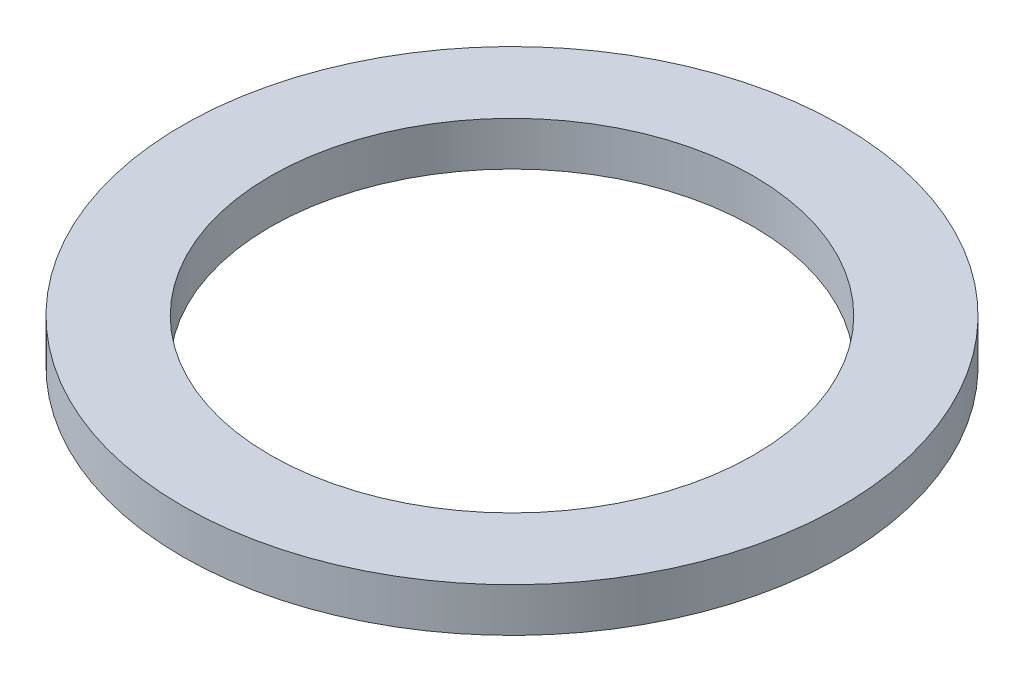
ISO-10303-21;
HEADER;
FILE_DESCRIPTION(('STEP AP214'),'2;1');
FILE_NAME('part.step','',(''),(''),'','','');
FILE_SCHEMA(('AUTOMOTIVE_DESIGN { 1 0 10303 214 1 1 1 1 }'));
ENDSEC;
DATA;
#1=APPLICATION_CONTEXT('core data for automotive mechanical design processes');
#2=APPLICATION_PROTOCOL_DEFINITION('international standard','automotive_design',2000,#1);
#3=PRODUCT_CONTEXT('',#1,'mechanical');
#4=PRODUCT('Part','Part','',(#3));
#5=PRODUCT_RELATED_PRODUCT_CATEGORY('part','',(#4));
#6=PRODUCT_DEFINITION_FORMATION('','',#4);
#7=PRODUCT_DEFINITION_CONTEXT('part definition',#1,'design');
#8=PRODUCT_DEFINITION('design','',#6,#7);
#9=PRODUCT_DEFINITION_SHAPE('','',#8);
#10=(LENGTH_UNIT() NAMED_UNIT(*) SI_UNIT(.MILLI.,.METRE.));
#11=(NAMED_UNIT(*) PLANE_ANGLE_UNIT() SI_UNIT($,.RADIAN.));
#12=(NAMED_UNIT(*) SI_UNIT($,.STERADIAN.) SOLID_ANGLE_UNIT());
#13=UNCERTAINTY_MEASURE_WITH_UNIT(LENGTH_MEASURE(1.E-05),#10,'distance_accuracy_value','');
#14=(GEOMETRIC_REPRESENTATION_CONTEXT(3) GLOBAL_UNCERTAINTY_ASSIGNED_CONTEXT((#13)) GLOBAL_UNIT_ASSIGNED_CONTEXT((#10,
#11,#12)) REPRESENTATION_CONTEXT('',''));
#15=CARTESIAN_POINT('',(0.,0.,0.));
#16=DIRECTION('',(0.,0.,1.));
#17=DIRECTION('',(1.,0.,0.));
#18=AXIS2_PLACEMENT_3D('',#15,#16,#17);
#19=CARTESIAN_POINT('',(0.,0.5,0.));
#20=DIRECTION('',(0.,1.,0.));
#21=DIRECTION('',(0.,0.,1.));
#22=AXIS2_PLACEMENT_3D('',#19,#20,#21);
#23=PLANE('',#22);
#24=CARTESIAN_POINT('',(0.,0.5,0.));
#25=DIRECTION('',(0.,1.,0.));
#26=DIRECTION('',(0.,0.,1.));
#27=AXIS2_PLACEMENT_3D('',#24,#25,#26);
#28=CIRCLE('',#27,3.75);
#29=CARTESIAN_POINT('',(0.,0.5,3.75));
#30=VERTEX_POINT('',#29);
#31=EDGE_CURVE('E10',#30,#30,#28,.T.);
#32=ORIENTED_EDGE('',*,*,#31,.T.);
#33=EDGE_LOOP('',(#32));
#34=FACE_BOUND('',#33,.T.);
#35=CARTESIAN_POINT('',(0.,0.5,0.));
#36=DIRECTION('',(0.,1.,0.));
#37=DIRECTION('',(0.,0.,1.));
#38=AXIS2_PLACEMENT_3D('',#35,#36,#37);
#39=CIRCLE('',#38,2.75);
#40=CARTESIAN_POINT('',(0.,0.5,2.75));
#41=VERTEX_POINT('',#40);
#42=EDGE_CURVE('E52',#41,#41,#39,.T.);
#43=ORIENTED_EDGE('',*,*,#42,.F.);
#44=EDGE_LOOP('',(#43));
#45=FACE_BOUND('',#44,.T.);
#46=ADVANCED_FACE('F39',(#34,#45),#23,.T.);
#47=CARTESIAN_POINT('',(0.,0.,0.));
#48=DIRECTION('',(0.,1.,0.));
#49=DIRECTION('',(0.,0.,1.));
#50=AXIS2_PLACEMENT_3D('',#47,#48,#49);
#51=PLANE('',#50);
#52=CARTESIAN_POINT('',(0.,0.,0.));
#53=DIRECTION('',(0.,1.,0.));
#54=DIRECTION('',(0.,0.,1.));
#55=AXIS2_PLACEMENT_3D('',#52,#53,#54);
#56=CIRCLE('',#55,3.75);
#57=CARTESIAN_POINT('',(0.,0.,3.75));
#58=VERTEX_POINT('',#57);
#59=EDGE_CURVE('E43',#58,#58,#56,.T.);
#60=ORIENTED_EDGE('',*,*,#59,.F.);
#61=EDGE_LOOP('',(#60));
#62=FACE_BOUND('',#61,.T.);
#63=CARTESIAN_POINT('',(0.,0.,0.));
#64=DIRECTION('',(0.,1.,0.));
#65=DIRECTION('',(0.,0.,1.));
#66=AXIS2_PLACEMENT_3D('',#63,#64,#65);
#67=CIRCLE('',#66,2.75);
#68=CARTESIAN_POINT('',(0.,0.,2.75));
#69=VERTEX_POINT('',#68);
#70=EDGE_CURVE('E54',#69,#69,#67,.T.);
#71=ORIENTED_EDGE('',*,*,#70,.T.);
#72=EDGE_LOOP('',(#71));
#73=FACE_BOUND('',#72,.T.);
#74=ADVANCED_FACE('F66',(#62,#73),#51,.F.);
#75=CARTESIAN_POINT('',(0.,0.5,0.));
#76=DIRECTION('',(0.,-1.,0.));
#77=DIRECTION('',(0.,0.,-1.));
#78=AXIS2_PLACEMENT_3D('',#75,#76,#77);
#79=CYLINDRICAL_SURFACE('',#78,3.75);
#80=ORIENTED_EDGE('',*,*,#31,.F.);
#81=EDGE_LOOP('',(#80));
#82=FACE_BOUND('',#81,.T.);
#83=ORIENTED_EDGE('',*,*,#59,.T.);
#84=EDGE_LOOP('',(#83));
#85=FACE_BOUND('',#84,.T.);
#86=ADVANCED_FACE('F41',(#82,#85),#79,.T.);
#87=CARTESIAN_POINT('',(0.,0.5,0.));
#88=DIRECTION('',(0.,-1.,0.));
#89=DIRECTION('',(0.,0.,-1.));
#90=AXIS2_PLACEMENT_3D('',#87,#88,#89);
#91=CYLINDRICAL_SURFACE('',#90,2.75);
#92=ORIENTED_EDGE('',*,*,#42,.T.);
#93=EDGE_LOOP('',(#92));
#94=FACE_BOUND('',#93,.T.);
#95=ORIENTED_EDGE('',*,*,#70,.F.);
#96=EDGE_LOOP('',(#95));
#97=FACE_BOUND('',#96,.T.);
#98=ADVANCED_FACE('F62',(#94,#97),#91,.F.);
#99=CLOSED_SHELL('',(#46,#74,#86,#98));
#100=MANIFOLD_SOLID_BREP('B2',#99);
#101=ADVANCED_BREP_SHAPE_REPRESENTATION('',(#18,#100),#14);
#102=SHAPE_DEFINITION_REPRESENTATION(#9,#101);
ENDSEC;
END-ISO-10303-21;
